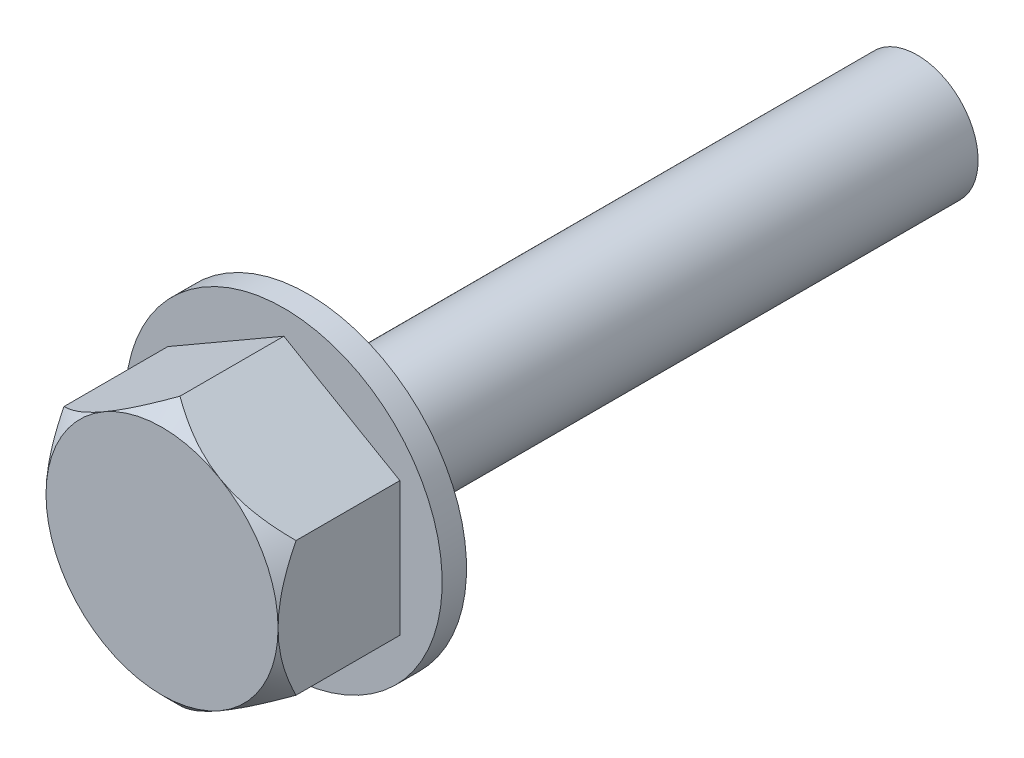
ISO-10303-21;
HEADER;
FILE_DESCRIPTION(('STEP AP214'),'2;1');
FILE_NAME('part.step','',(''),(''),'','','');
FILE_SCHEMA(('AUTOMOTIVE_DESIGN { 1 0 10303 214 1 1 1 1 }'));
ENDSEC;
DATA;
#1=APPLICATION_CONTEXT('core data for automotive mechanical design processes');
#2=APPLICATION_PROTOCOL_DEFINITION('international standard','automotive_design',2000,#1);
#3=PRODUCT_CONTEXT('',#1,'mechanical');
#4=PRODUCT('Part','Part','',(#3));
#5=PRODUCT_RELATED_PRODUCT_CATEGORY('part','',(#4));
#6=PRODUCT_DEFINITION_FORMATION('','',#4);
#7=PRODUCT_DEFINITION_CONTEXT('part definition',#1,'design');
#8=PRODUCT_DEFINITION('design','',#6,#7);
#9=PRODUCT_DEFINITION_SHAPE('','',#8);
#10=(LENGTH_UNIT() NAMED_UNIT(*) SI_UNIT(.MILLI.,.METRE.));
#11=(NAMED_UNIT(*) PLANE_ANGLE_UNIT() SI_UNIT($,.RADIAN.));
#12=(NAMED_UNIT(*) SI_UNIT($,.STERADIAN.) SOLID_ANGLE_UNIT());
#13=UNCERTAINTY_MEASURE_WITH_UNIT(LENGTH_MEASURE(1.E-05),#10,'distance_accuracy_value','');
#14=(GEOMETRIC_REPRESENTATION_CONTEXT(3) GLOBAL_UNCERTAINTY_ASSIGNED_CONTEXT((#13)) GLOBAL_UNIT_ASSIGNED_CONTEXT((#10,
#11,#12)) REPRESENTATION_CONTEXT('',''));
#15=CARTESIAN_POINT('',(0.,0.,0.));
#16=DIRECTION('',(0.,0.,1.));
#17=DIRECTION('',(1.,0.,0.));
#18=AXIS2_PLACEMENT_3D('',#15,#16,#17);
#19=CARTESIAN_POINT('',(-4.76313972081438,-2.75000000000005,-5.));
#20=DIRECTION('',(-0.499999999999995,-0.866025403784441,0.));
#21=DIRECTION('',(0.866025403784441,-0.499999999999995,0.));
#22=AXIS2_PLACEMENT_3D('',#19,#20,#21);
#23=PLANE('',#22);
#24=DIRECTION('',(0.,0.,1.));
#25=VECTOR('',#24,1.);
#26=CARTESIAN_POINT('',(0.,-5.5,-5.));
#27=LINE('',#26,#25);
#28=CARTESIAN_POINT('',(0.,-5.5,-5.));
#29=VERTEX_POINT('',#28);
#30=CARTESIAN_POINT('',(0.,-5.5,-0.736860279185588));
#31=VERTEX_POINT('',#30);
#32=EDGE_CURVE('E125',#29,#31,#27,.T.);
#33=ORIENTED_EDGE('',*,*,#32,.T.);
#34=CARTESIAN_POINT('',(0.000199999999999947,-5.50011547005384,-0.736975752875714));
#35=CARTESIAN_POINT('',(-0.0817003470262866,-5.45283028265149,-0.689694685548292));
#36=CARTESIAN_POINT('',(-0.164230225744076,-5.40518163495759,-0.643864576965731));
#37=CARTESIAN_POINT('',(-0.330672557559919,-5.30908610987916,-0.555547663203381));
#38=CARTESIAN_POINT('',(-0.414585735957058,-5.26063881374302,-0.513062684050777));
#39=CARTESIAN_POINT('',(-0.669365101218748,-5.11354187862522,-0.390925204626404));
#40=CARTESIAN_POINT('',(-0.84238815690256,-5.01364697085016,-0.317111231818438));
#41=CARTESIAN_POINT('',(-1.19130301448484,-4.81220088390078,-0.190709770145647));
#42=CARTESIAN_POINT('',(-1.3671056306834,-4.7107011961143,-0.137803823169366));
#43=CARTESIAN_POINT('',(-1.63369990023506,-4.55678292282424,-0.0766045532619521));
#44=CARTESIAN_POINT('',(-1.72295716505968,-4.50525021695061,-0.0592395898835631));
#45=CARTESIAN_POINT('',(-1.90222747152857,-4.4017484572531,-0.0309558439278378));
#46=CARTESIAN_POINT('',(-1.99224039817511,-4.34977946982317,-0.0200360979179911));
#47=CARTESIAN_POINT('',(-2.21158720877784,-4.2231395296758,-0.00172772122849488));
#48=CARTESIAN_POINT('',(-2.34115742565004,-4.14833213008567,0.00211388269245642));
#49=CARTESIAN_POINT('',(-2.60006435339632,-3.9988521456563,-0.00433297330770614));
#50=CARTESIAN_POINT('',(-2.72940096650445,-3.92417961726225,-0.0146263864778779));
#51=CARTESIAN_POINT('',(-2.9868548554005,-3.7755385452042,-0.0487365191046505));
#52=CARTESIAN_POINT('',(-3.11497060430222,-3.70157088308837,-0.0725683627031131));
#53=CARTESIAN_POINT('',(-3.36900011460575,-3.55490687693252,-0.132459701208678));
#54=CARTESIAN_POINT('',(-3.49491404406779,-3.48221043586288,-0.168518258554821));
#55=CARTESIAN_POINT('',(-3.71843824070332,-3.35315868076497,-0.242703334416508));
#56=CARTESIAN_POINT('',(-3.81654337228758,-3.29651765663591,-0.2788791293767));
#57=CARTESIAN_POINT('',(-4.01099245484344,-3.18425242647861,-0.357060576143164));
#58=CARTESIAN_POINT('',(-4.1073363522142,-3.12862825139682,-0.399066405045612));
#59=CARTESIAN_POINT('',(-4.2979595242532,-3.01857191170633,-0.487966239375994));
#60=CARTESIAN_POINT('',(-4.39224422044242,-2.96413661698102,-0.53484487306658));
#61=CARTESIAN_POINT('',(-4.57906764030394,-2.85627406523305,-0.632874795145085));
#62=CARTESIAN_POINT('',(-4.67160739285723,-2.80284621418566,-0.684023462634268));
#63=CARTESIAN_POINT('',(-4.76333972081438,-2.74988452994622,-0.736975752875713));
#64=B_SPLINE_CURVE_WITH_KNOTS('',3,(#34,#35,#36,#37,#38,#39,#40,#41,#42,#43,#44,#45,#46,#47,#48,
#49,#50,#51,#52,#53,#54,#55,#56,#57,#58,#59,#60,#61,#62,#63),.UNSPECIFIED.,.F.,.F.,(4,2,2,2,2,2,
2,2,2,2,2,2,2,2,4),(0.,0.317174593195835,0.634521141153642,1.27264058749772,1.90062684773362,
2.21400406042552,2.52733441755152,2.97562912372917,3.42408096321992,3.87303476817696,
4.32195415453099,4.67854100660272,5.03513869291573,5.39064376324431,5.74593221064629),.UNSPECIFIED.);
#65=CARTESIAN_POINT('',(-2.38156986040718,-4.12500000000001,0.));
#66=VERTEX_POINT('',#65);
#67=EDGE_CURVE('E63',#31,#66,#64,.T.);
#68=ORIENTED_EDGE('',*,*,#67,.T.);
#69=CARTESIAN_POINT('',(-4.76313972081438,-2.75000000000005,-0.736860279185588));
#70=VERTEX_POINT('',#69);
#71=EDGE_CURVE('E137',#66,#70,#64,.T.);
#72=ORIENTED_EDGE('',*,*,#71,.T.);
#73=DIRECTION('',(0.,0.,1.));
#74=VECTOR('',#73,1.);
#75=CARTESIAN_POINT('',(-4.76313972081438,-2.75000000000005,-5.));
#76=LINE('',#75,#74);
#77=CARTESIAN_POINT('',(-4.76313972081438,-2.75000000000005,-5.));
#78=VERTEX_POINT('',#77);
#79=EDGE_CURVE('E134',#78,#70,#76,.T.);
#80=ORIENTED_EDGE('',*,*,#79,.F.);
#81=DIRECTION('',(0.866025403784441,-0.499999999999995,0.));
#82=VECTOR('',#81,1.);
#83=CARTESIAN_POINT('',(-4.76313972081438,-2.75000000000005,-5.));
#84=LINE('',#83,#82);
#85=EDGE_CURVE('E116',#78,#29,#84,.T.);
#86=ORIENTED_EDGE('',*,*,#85,.T.);
#87=EDGE_LOOP('',(#33,#68,#72,#80,#86));
#88=FACE_BOUND('',#87,.T.);
#89=ADVANCED_FACE('F38',(#88),#23,.T.);
#90=CARTESIAN_POINT('',(-4.76313972081444,2.74999999999996,-5.));
#91=DIRECTION('',(-1.,0.,0.));
#92=DIRECTION('',(0.,-1.,0.));
#93=AXIS2_PLACEMENT_3D('',#90,#91,#92);
#94=PLANE('',#93);
#95=ORIENTED_EDGE('',*,*,#79,.T.);
#96=CARTESIAN_POINT('',(-4.7631397208143,-9.96474736936947,-6.28148295881364));
#97=CARTESIAN_POINT('',(-4.76313972081431,-9.8194641237829,-6.15040750400947));
#98=CARTESIAN_POINT('',(-4.76313972081431,-9.67391870517606,-6.01962248484121));
#99=CARTESIAN_POINT('',(-4.76313972081431,-9.38223157542293,-5.75871878164263));
#100=CARTESIAN_POINT('',(-4.76313972081431,-9.23608986338274,-5.62860009861187));
#101=CARTESIAN_POINT('',(-4.76313972081432,-8.79657578364714,-5.23929506633062));
#102=CARTESIAN_POINT('',(-4.76313972081432,-8.50220091479208,-4.9812379021764));
#103=CARTESIAN_POINT('',(-4.76313972081433,-7.90709800761804,-4.46654620790231));
#104=CARTESIAN_POINT('',(-4.76313972081433,-7.60633593823235,-4.20995088688188));
#105=CARTESIAN_POINT('',(-4.76313972081433,-7.15176487956565,-3.82920746179781));
#106=CARTESIAN_POINT('',(-4.76313972081434,-6.99968458283192,-3.7029964571668));
#107=CARTESIAN_POINT('',(-4.76313972081434,-6.69416963001136,-3.4522001511214));
#108=CARTESIAN_POINT('',(-4.76313972081434,-6.54073486069522,-3.32761498782123));
#109=CARTESIAN_POINT('',(-4.76313972081434,-6.10924062059504,-2.98170821248723));
#110=CARTESIAN_POINT('',(-4.76313972081435,-5.82944384431965,-2.76253177121416));
#111=CARTESIAN_POINT('',(-4.76313972081435,-5.40476464042109,-2.44036994149421));
#112=CARTESIAN_POINT('',(-4.76313972081435,-5.26238112901092,-2.33408803915039));
#113=CARTESIAN_POINT('',(-4.76313972081436,-4.97566966699846,-2.12418414246091));
#114=CARTESIAN_POINT('',(-4.76313972081436,-4.83134179195008,-2.0205620452128));
#115=CARTESIAN_POINT('',(-4.76313972081436,-4.5407079622675,-1.81674023917084));
#116=CARTESIAN_POINT('',(-4.76313972081436,-4.39440647213127,-1.71653418147474));
#117=CARTESIAN_POINT('',(-4.76313972081437,-4.09918613232495,-1.52006674655576));
#118=CARTESIAN_POINT('',(-4.76313972081437,-3.95026750137534,-1.42380504191322));
#119=CARTESIAN_POINT('',(-4.76313972081437,-3.64947681847324,-1.23622397003319));
#120=CARTESIAN_POINT('',(-4.76313972081437,-3.49760685430108,-1.14490127037007));
#121=CARTESIAN_POINT('',(-4.76313972081438,-3.19036684314799,-0.968363616521689));
#122=CARTESIAN_POINT('',(-4.76313972081438,-3.0349973680281,-0.883147673802277));
#123=CARTESIAN_POINT('',(-4.76313972081438,-2.72949302776217,-0.725171508495284));
#124=CARTESIAN_POINT('',(-4.76313972081438,-2.57958588365036,-0.651973831254236));
#125=CARTESIAN_POINT('',(-4.76313972081438,-2.27587119230448,-0.514055337321866));
#126=CARTESIAN_POINT('',(-4.76313972081439,-2.1220633759172,-0.449335107499267));
#127=CARTESIAN_POINT('',(-4.76313972081439,-1.81074973674743,-0.330549568695687));
#128=CARTESIAN_POINT('',(-4.76313972081439,-1.65325331142752,-0.276459911575746));
#129=CARTESIAN_POINT('',(-4.76313972081439,-1.3344497210784,-0.181066001857871));
#130=CARTESIAN_POINT('',(-4.7631397208144,-1.17314446724577,-0.139755477750318));
#131=CARTESIAN_POINT('',(-4.7631397208144,-0.87326689022643,-0.0775352041917559));
#132=CARTESIAN_POINT('',(-4.7631397208144,-0.73515336354498,-0.0544272815044862));
#133=CARTESIAN_POINT('',(-4.7631397208144,-0.457466196822941,-0.0199360371249379));
#134=CARTESIAN_POINT('',(-4.76313972081441,-0.317892786174683,-0.00855090057246982));
#135=CARTESIAN_POINT('',(-4.76313972081441,-0.0384574659023621,0.00188822402369194));
#136=CARTESIAN_POINT('',(-4.76313972081441,0.101403843691035,0.000958016781422012));
#137=CARTESIAN_POINT('',(-4.76313972081441,0.380512188123441,-0.0131398272199835));
#138=CARTESIAN_POINT('',(-4.76313972081441,0.519759136740562,-0.02630913000906));
#139=CARTESIAN_POINT('',(-4.76313972081442,0.830680905799937,-0.0688750596399007));
#140=CARTESIAN_POINT('',(-4.76313972081442,1.00191866122046,-0.101463313009136));
#141=CARTESIAN_POINT('',(-4.76313972081442,1.34068148647521,-0.182342635637698));
#142=CARTESIAN_POINT('',(-4.76313972081442,1.50820424110581,-0.230643218550643));
#143=CARTESIAN_POINT('',(-4.76313972081443,1.75661452670975,-0.312984909706596));
#144=CARTESIAN_POINT('',(-4.76313972081443,1.83915865201396,-0.342173222657684));
#145=CARTESIAN_POINT('',(-4.76313972081443,2.00310532499562,-0.403499071646121));
#146=CARTESIAN_POINT('',(-4.76313972081443,2.0845083693278,-0.435635275570389));
#147=CARTESIAN_POINT('',(-4.76313972081443,2.24620795881391,-0.502553921075972));
#148=CARTESIAN_POINT('',(-4.76313972081443,2.32650458018099,-0.537336179303356));
#149=CARTESIAN_POINT('',(-4.76313972081443,2.48603613357505,-0.609272841131835));
#150=CARTESIAN_POINT('',(-4.76313972081444,2.56527092702329,-0.646427550782213));
#151=CARTESIAN_POINT('',(-4.76313972081444,2.89412413331974,-0.806015832116659));
#152=CARTESIAN_POINT('',(-4.76313972081444,3.13912931524198,-0.938004938001573));
#153=CARTESIAN_POINT('',(-4.76313972081445,3.62066445143717,-1.21667499148629));
#154=CARTESIAN_POINT('',(-4.76313972081445,3.85718803181078,-1.36336668638422));
#155=CARTESIAN_POINT('',(-4.76313972081445,4.3240244071607,-1.66751266588977));
#156=CARTESIAN_POINT('',(-4.76313972081446,4.55431987438763,-1.82499337675008));
#157=CARTESIAN_POINT('',(-4.76313972081446,5.0094539624986,-2.14745934347511));
#158=CARTESIAN_POINT('',(-4.76313972081446,5.23429412427803,-2.31244244147846));
#159=CARTESIAN_POINT('',(-4.76313972081447,5.68080506105937,-2.64883795112529));
#160=CARTESIAN_POINT('',(-4.76313972081447,5.90245519471754,-2.82027764698549));
#161=CARTESIAN_POINT('',(-4.76313972081447,6.34235286574879,-3.16747927973048));
#162=CARTESIAN_POINT('',(-4.76313972081448,6.56060020491732,-3.34324146686448));
#163=CARTESIAN_POINT('',(-4.76313972081448,6.99405466123267,-3.69787684812839));
#164=CARTESIAN_POINT('',(-4.76313972081448,7.20926548390335,-3.87674552356452));
#165=CARTESIAN_POINT('',(-4.76313972081449,7.63744961082177,-4.23712665270878));
#166=CARTESIAN_POINT('',(-4.76313972081449,7.85042296288583,-4.41863904972009));
#167=CARTESIAN_POINT('',(-4.7631397208145,8.38422376965678,-4.87822108752157));
#168=CARTESIAN_POINT('',(-4.7631397208145,8.70386035988949,-5.15767346824373));
#169=CARTESIAN_POINT('',(-4.7631397208145,9.17978597667877,-5.57855211265872));
#170=CARTESIAN_POINT('',(-4.76313972081451,9.33727992750878,-5.7186219806635));
#171=CARTESIAN_POINT('',(-4.76313972081451,9.65153287771948,-5.99950988397989));
#172=CARTESIAN_POINT('',(-4.76313972081451,9.80829204097808,-6.14032773590688));
#173=CARTESIAN_POINT('',(-4.76313972081451,9.96474736936938,-6.28148295881362));
#174=B_SPLINE_CURVE_WITH_KNOTS('',3,(#96,#97,#98,#99,#100,#101,#102,#103,#104,#105,#106,#107,
#108,#109,#110,#111,#112,#113,#114,#115,#116,#117,#118,#119,#120,#121,#122,#123,#124,#125,#126,
#127,#128,#129,#130,#131,#132,#133,#134,#135,#136,#137,#138,#139,#140,#141,#142,#143,#144,#145,
#146,#147,#148,#149,#150,#151,#152,#153,#154,#155,#156,#157,#158,#159,#160,#161,#162,#163,#164,
#165,#166,#167,#168,#169,#170,#171,#172,#173),.UNSPECIFIED.,.F.,.F.,(4,2,2,2,2,2,2,2,2,2,2,2,2,
2,2,2,2,2,2,2,2,2,2,2,2,2,2,2,2,2,2,2,2,2,2,2,2,2,4),(0.,0.587019100354334,1.17403908103397,
2.34842866011225,3.53441461258711,4.12729414409058,4.72022371672311,5.78633737356322,
6.31934345914652,6.85232889262923,7.38426276308394,7.91615238803062,8.44767854283795,
8.97911846132891,9.47937767016599,9.97967149219264,10.4788057402889,10.9776946423464,
11.3973410781643,11.816922536752,12.235965583942,12.6550656811429,13.1771207995729,
13.6994926071962,13.9621052178759,14.2245997365447,14.4870760826313,14.7495863571789,
15.5836094863241,16.4182467786879,17.2550070219913,18.0915280972779,18.9321033310732,
19.7727273447939,20.6122168659544,21.4516884099938,22.7253609187822,23.3576687618174,
23.9898281446097),.UNSPECIFIED.);
#175=CARTESIAN_POINT('',(-4.76313972081441,0.,0.));
#176=VERTEX_POINT('',#175);
#177=EDGE_CURVE('E247',#70,#176,#174,.T.);
#178=ORIENTED_EDGE('',*,*,#177,.T.);
#179=CARTESIAN_POINT('',(-4.76313972081444,2.74999999999996,-0.736860279185588));
#180=VERTEX_POINT('',#179);
#181=EDGE_CURVE('E220',#176,#180,#174,.T.);
#182=ORIENTED_EDGE('',*,*,#181,.T.);
#183=DIRECTION('',(0.,0.,1.));
#184=VECTOR('',#183,1.);
#185=CARTESIAN_POINT('',(-4.76313972081444,2.74999999999996,-5.));
#186=LINE('',#185,#184);
#187=CARTESIAN_POINT('',(-4.76313972081444,2.74999999999996,-5.));
#188=VERTEX_POINT('',#187);
#189=EDGE_CURVE('E155',#188,#180,#186,.T.);
#190=ORIENTED_EDGE('',*,*,#189,.F.);
#191=DIRECTION('',(0.,-1.,0.));
#192=VECTOR('',#191,1.);
#193=CARTESIAN_POINT('',(-4.76313972081444,2.74999999999996,-5.));
#194=LINE('',#193,#192);
#195=EDGE_CURVE('E131',#188,#78,#194,.T.);
#196=ORIENTED_EDGE('',*,*,#195,.T.);
#197=EDGE_LOOP('',(#95,#178,#182,#190,#196));
#198=FACE_BOUND('',#197,.T.);
#199=ADVANCED_FACE('F229',(#198),#94,.T.);
#200=CARTESIAN_POINT('',(0.,5.5,-5.));
#201=DIRECTION('',(-0.500000000000007,0.866025403784435,0.));
#202=DIRECTION('',(-0.866025403784435,-0.500000000000007,0.));
#203=AXIS2_PLACEMENT_3D('',#200,#201,#202);
#204=PLANE('',#203);
#205=ORIENTED_EDGE('',*,*,#189,.T.);
#206=CARTESIAN_POINT('',(-4.76333972081444,2.74988452994612,-0.736975752875713));
#207=CARTESIAN_POINT('',(-4.68143937378815,2.79716971734847,-0.68969468554829));
#208=CARTESIAN_POINT('',(-4.59890949507036,2.84481836504237,-0.643864576965729));
#209=CARTESIAN_POINT('',(-4.43246716325452,2.9409138901208,-0.555547663203377));
#210=CARTESIAN_POINT('',(-4.34855398485738,2.98936118625695,-0.513062684050771));
#211=CARTESIAN_POINT('',(-4.09377461959569,3.13645812137475,-0.390925204626394));
#212=CARTESIAN_POINT('',(-3.92075156391187,3.23635302914981,-0.317111231818426));
#213=CARTESIAN_POINT('',(-3.5718367063296,3.4377991160992,-0.190709770145632));
#214=CARTESIAN_POINT('',(-3.39603409013103,3.53929880388569,-0.13780382316935));
#215=CARTESIAN_POINT('',(-3.12943982057938,3.69321707717575,-0.0766045532619348));
#216=CARTESIAN_POINT('',(-3.04018255575475,3.74474978304938,-0.0592395898835454));
#217=CARTESIAN_POINT('',(-2.86091224928586,3.8482515427469,-0.0309558439278192));
#218=CARTESIAN_POINT('',(-2.77089932263932,3.90022053017683,-0.0200360979179722));
#219=CARTESIAN_POINT('',(-2.5515525120366,4.0268604703242,-0.00172772122847576));
#220=CARTESIAN_POINT('',(-2.42198229516439,4.10166786991433,0.00211388269247535));
#221=CARTESIAN_POINT('',(-2.16307536741811,4.2511478543437,-0.00433297330768649));
#222=CARTESIAN_POINT('',(-2.03373875430998,4.32582038273776,-0.0146263864778574));
#223=CARTESIAN_POINT('',(-1.77628486541394,4.47446145479581,-0.0487365191046294));
#224=CARTESIAN_POINT('',(-1.64816911651222,4.54842911691164,-0.0725683627030924));
#225=CARTESIAN_POINT('',(-1.3941396062087,4.6950931230675,-0.132459701208658));
#226=CARTESIAN_POINT('',(-1.26822567674666,4.76778956413713,-0.1685182585548));
#227=CARTESIAN_POINT('',(-1.04470148011113,4.89684131923505,-0.242703334416488));
#228=CARTESIAN_POINT('',(-0.946596348526861,4.95348234336411,-0.27887912937668));
#229=CARTESIAN_POINT('',(-0.752147265970998,5.06574757352142,-0.357060576143148));
#230=CARTESIAN_POINT('',(-0.655803368600229,5.12137174860321,-0.399066405045598));
#231=CARTESIAN_POINT('',(-0.465180196561227,5.23142808829371,-0.487966239375983));
#232=CARTESIAN_POINT('',(-0.370895500372006,5.28586338301902,-0.534844873066572));
#233=CARTESIAN_POINT('',(-0.18407208051048,5.393725934767,-0.632874795145081));
#234=CARTESIAN_POINT('',(-0.0915323279571858,5.44715378581439,-0.684023462634266));
#235=CARTESIAN_POINT('',(0.000199999999962002,5.50011547005384,-0.736975752875713));
#236=B_SPLINE_CURVE_WITH_KNOTS('',3,(#206,#207,#208,#209,#210,#211,#212,#213,#214,#215,#216,
#217,#218,#219,#220,#221,#222,#223,#224,#225,#226,#227,#228,#229,#230,#231,#232,#233,#234,#235),
.UNSPECIFIED.,.F.,.F.,(4,2,2,2,2,2,2,2,2,2,2,2,2,2,4),(0.,0.317174593195838,0.634521141153649,
1.27264058749774,1.90062684773364,2.21400406042555,2.52733441755155,2.9756291237292,
3.42408096321995,3.87303476817699,4.32195415453101,4.67854100660276,5.03513869291578,
5.39064376324437,5.74593221064637),.UNSPECIFIED.);
#237=CARTESIAN_POINT('',(-2.38156986040724,4.12499999999998,0.));
#238=VERTEX_POINT('',#237);
#239=EDGE_CURVE('E218',#180,#238,#236,.T.);
#240=ORIENTED_EDGE('',*,*,#239,.T.);
#241=CARTESIAN_POINT('',(0.,5.5,-0.736860279185588));
#242=VERTEX_POINT('',#241);
#243=EDGE_CURVE('E211',#238,#242,#236,.T.);
#244=ORIENTED_EDGE('',*,*,#243,.T.);
#245=DIRECTION('',(0.,0.,1.));
#246=VECTOR('',#245,1.);
#247=CARTESIAN_POINT('',(0.,5.5,-5.));
#248=LINE('',#247,#246);
#249=CARTESIAN_POINT('',(0.,5.5,-5.));
#250=VERTEX_POINT('',#249);
#251=EDGE_CURVE('E158',#250,#242,#248,.T.);
#252=ORIENTED_EDGE('',*,*,#251,.F.);
#253=DIRECTION('',(-0.866025403784434,-0.500000000000007,0.));
#254=VECTOR('',#253,1.);
#255=CARTESIAN_POINT('',(0.,5.5,-5.));
#256=LINE('',#255,#254);
#257=EDGE_CURVE('E150',#250,#188,#256,.T.);
#258=ORIENTED_EDGE('',*,*,#257,.T.);
#259=EDGE_LOOP('',(#205,#240,#244,#252,#258));
#260=FACE_BOUND('',#259,.T.);
#261=ADVANCED_FACE('F225',(#260),#204,.T.);
#262=CARTESIAN_POINT('',(4.7631397208144,2.75000000000002,-5.));
#263=DIRECTION('',(0.499999999999995,0.866025403784442,0.));
#264=DIRECTION('',(-0.866025403784442,0.499999999999995,0.));
#265=AXIS2_PLACEMENT_3D('',#262,#263,#264);
#266=PLANE('',#265);
#267=ORIENTED_EDGE('',*,*,#251,.T.);
#268=CARTESIAN_POINT('',(-0.000200000000038219,5.50011547005384,-0.736975752875713));
#269=CARTESIAN_POINT('',(0.0817003470262488,5.45283028265149,-0.68969468554829));
#270=CARTESIAN_POINT('',(0.164230225744038,5.40518163495758,-0.643864576965728));
#271=CARTESIAN_POINT('',(0.330672557559883,5.30908610987916,-0.555547663203377));
#272=CARTESIAN_POINT('',(0.414585735957023,5.26063881374301,-0.513062684050771));
#273=CARTESIAN_POINT('',(0.669365101218715,5.11354187862521,-0.390925204626395));
#274=CARTESIAN_POINT('',(0.842388156902529,5.01364697085016,-0.317111231818427));
#275=CARTESIAN_POINT('',(1.19130301448481,4.81220088390077,-0.190709770145633));
#276=CARTESIAN_POINT('',(1.36710563068337,4.71070119611429,-0.13780382316935));
#277=CARTESIAN_POINT('',(1.63369990023503,4.55678292282423,-0.0766045532619356));
#278=CARTESIAN_POINT('',(1.72295716505966,4.5052502169506,-0.0592395898835468));
#279=CARTESIAN_POINT('',(1.90222747152855,4.40174845725308,-0.0309558439278207));
#280=CARTESIAN_POINT('',(1.99224039817509,4.34977946982316,-0.0200360979179731));
#281=CARTESIAN_POINT('',(2.21158720877782,4.22313952967579,-0.00172772122847552));
#282=CARTESIAN_POINT('',(2.34115742565002,4.14833213008566,0.0021138826924761));
#283=CARTESIAN_POINT('',(2.6000643533963,3.99885214565629,-0.00433297330768594));
#284=CARTESIAN_POINT('',(2.72940096650443,3.92417961726224,-0.0146263864778576));
#285=CARTESIAN_POINT('',(2.98685485540048,3.77553854520419,-0.0487365191046295));
#286=CARTESIAN_POINT('',(3.1149706043022,3.70157088308836,-0.0725683627030915));
#287=CARTESIAN_POINT('',(3.36900011460573,3.55490687693251,-0.132459701208656));
#288=CARTESIAN_POINT('',(3.49491404406776,3.48221043586288,-0.168518258554797));
#289=CARTESIAN_POINT('',(3.71843824070329,3.35315868076496,-0.242703334416486));
#290=CARTESIAN_POINT('',(3.81654337228756,3.2965176566359,-0.278879129376678));
#291=CARTESIAN_POINT('',(4.01099245484343,3.1842524264786,-0.357060576143147));
#292=CARTESIAN_POINT('',(4.1073363522142,3.1286282513968,-0.399066405045597));
#293=CARTESIAN_POINT('',(4.29795952425321,3.01857191170631,-0.487966239375983));
#294=CARTESIAN_POINT('',(4.39224422044243,2.964136616981,-0.534844873066572));
#295=CARTESIAN_POINT('',(4.57906764030396,2.85627406523302,-0.632874795145081));
#296=CARTESIAN_POINT('',(4.67160739285725,2.80284621418563,-0.684023462634267));
#297=CARTESIAN_POINT('',(4.7633397208144,2.74988452994618,-0.736975752875714));
#298=B_SPLINE_CURVE_WITH_KNOTS('',3,(#268,#269,#270,#271,#272,#273,#274,#275,#276,#277,#278,
#279,#280,#281,#282,#283,#284,#285,#286,#287,#288,#289,#290,#291,#292,#293,#294,#295,#296,#297),
.UNSPECIFIED.,.F.,.F.,(4,2,2,2,2,2,2,2,2,2,2,2,2,2,4),(0.,0.317174593195838,0.634521141153649,
1.27264058749773,1.90062684773364,2.21400406042554,2.52733441755154,2.9756291237292,
3.42408096321995,3.87303476817698,4.32195415453101,4.67854100660275,5.03513869291578,
5.39064376324438,5.74593221064637),.UNSPECIFIED.);
#299=CARTESIAN_POINT('',(2.38156986040718,4.12500000000001,0.));
#300=VERTEX_POINT('',#299);
#301=EDGE_CURVE('E219',#242,#300,#298,.T.);
#302=ORIENTED_EDGE('',*,*,#301,.T.);
#303=CARTESIAN_POINT('',(4.7631397208144,2.75000000000002,-0.736860279185588));
#304=VERTEX_POINT('',#303);
#305=EDGE_CURVE('E175',#300,#304,#298,.T.);
#306=ORIENTED_EDGE('',*,*,#305,.T.);
#307=DIRECTION('',(0.,0.,1.));
#308=VECTOR('',#307,1.);
#309=CARTESIAN_POINT('',(4.7631397208144,2.75000000000002,-5.));
#310=LINE('',#309,#308);
#311=CARTESIAN_POINT('',(4.7631397208144,2.75000000000002,-5.));
#312=VERTEX_POINT('',#311);
#313=EDGE_CURVE('E161',#312,#304,#310,.T.);
#314=ORIENTED_EDGE('',*,*,#313,.F.);
#315=DIRECTION('',(-0.866025403784441,0.499999999999995,0.));
#316=VECTOR('',#315,1.);
#317=CARTESIAN_POINT('',(4.7631397208144,2.75000000000002,-5.));
#318=LINE('',#317,#316);
#319=EDGE_CURVE('E147',#312,#250,#318,.T.);
#320=ORIENTED_EDGE('',*,*,#319,.T.);
#321=EDGE_LOOP('',(#267,#302,#306,#314,#320));
#322=FACE_BOUND('',#321,.T.);
#323=ADVANCED_FACE('F228',(#322),#266,.T.);
#324=CARTESIAN_POINT('',(4.76313972081442,-2.74999999999999,-5.));
#325=DIRECTION('',(1.,0.,0.));
#326=DIRECTION('',(0.,1.,0.));
#327=AXIS2_PLACEMENT_3D('',#324,#325,#326);
#328=PLANE('',#327);
#329=ORIENTED_EDGE('',*,*,#313,.T.);
#330=CARTESIAN_POINT('',(4.76313972081438,9.96474736936943,-6.28148295881364));
#331=CARTESIAN_POINT('',(4.76313972081438,9.81946412378287,-6.15040750400947));
#332=CARTESIAN_POINT('',(4.76313972081438,9.67391870517603,-6.01962248484121));
#333=CARTESIAN_POINT('',(4.76313972081438,9.3822315754229,-5.75871878164263));
#334=CARTESIAN_POINT('',(4.76313972081438,9.23608986338271,-5.62860009861187));
#335=CARTESIAN_POINT('',(4.76313972081438,8.79657578364711,-5.23929506633062));
#336=CARTESIAN_POINT('',(4.76313972081438,8.50220091479205,-4.9812379021764));
#337=CARTESIAN_POINT('',(4.76313972081438,7.90709800761801,-4.4665462079023));
#338=CARTESIAN_POINT('',(4.76313972081438,7.60633593823232,-4.20995088688188));
#339=CARTESIAN_POINT('',(4.76313972081438,7.15176487956561,-3.82920746179781));
#340=CARTESIAN_POINT('',(4.76313972081439,6.99968458283189,-3.7029964571668));
#341=CARTESIAN_POINT('',(4.76313972081439,6.69416963001133,-3.4522001511214));
#342=CARTESIAN_POINT('',(4.76313972081439,6.54073486069519,-3.32761498782123));
#343=CARTESIAN_POINT('',(4.76313972081439,6.109240620595,-2.98170821248723));
#344=CARTESIAN_POINT('',(4.76313972081439,5.82944384431962,-2.76253177121415));
#345=CARTESIAN_POINT('',(4.76313972081439,5.40476464042106,-2.44036994149421));
#346=CARTESIAN_POINT('',(4.76313972081439,5.26238112901089,-2.33408803915039));
#347=CARTESIAN_POINT('',(4.76313972081439,4.97566966699843,-2.12418414246091));
#348=CARTESIAN_POINT('',(4.76313972081439,4.83134179195004,-2.0205620452128));
#349=CARTESIAN_POINT('',(4.76313972081439,4.54070796226747,-1.81674023917084));
#350=CARTESIAN_POINT('',(4.76313972081439,4.39440647213124,-1.71653418147474));
#351=CARTESIAN_POINT('',(4.76313972081439,4.09918613232492,-1.52006674655576));
#352=CARTESIAN_POINT('',(4.7631397208144,3.95026750137531,-1.42380504191322));
#353=CARTESIAN_POINT('',(4.7631397208144,3.6494768184732,-1.23622397003319));
#354=CARTESIAN_POINT('',(4.7631397208144,3.49760685430104,-1.14490127037007));
#355=CARTESIAN_POINT('',(4.7631397208144,3.19036684314795,-0.968363616521688));
#356=CARTESIAN_POINT('',(4.7631397208144,3.03499736802806,-0.883147673802276));
#357=CARTESIAN_POINT('',(4.7631397208144,2.72949302776213,-0.725171508495283));
#358=CARTESIAN_POINT('',(4.7631397208144,2.57958588365032,-0.651973831254235));
#359=CARTESIAN_POINT('',(4.7631397208144,2.27587119230445,-0.514055337321865));
#360=CARTESIAN_POINT('',(4.7631397208144,2.12206337591716,-0.449335107499265));
#361=CARTESIAN_POINT('',(4.7631397208144,1.81074973674739,-0.330549568695685));
#362=CARTESIAN_POINT('',(4.7631397208144,1.65325331142748,-0.276459911575744));
#363=CARTESIAN_POINT('',(4.76313972081441,1.33444972107836,-0.18106600185787));
#364=CARTESIAN_POINT('',(4.76313972081441,1.17314446724573,-0.139755477750318));
#365=CARTESIAN_POINT('',(4.76313972081441,0.873266890226392,-0.0775352041917559));
#366=CARTESIAN_POINT('',(4.76313972081441,0.735153363544943,-0.0544272815044864));
#367=CARTESIAN_POINT('',(4.76313972081441,0.457466196822903,-0.0199360371249385));
#368=CARTESIAN_POINT('',(4.76313972081441,0.317892786174646,-0.00855090057247068));
#369=CARTESIAN_POINT('',(4.76313972081441,0.0384574659023256,0.00188822402369117));
#370=CARTESIAN_POINT('',(4.76313972081441,-0.101403843691071,0.000958016781421545));
#371=CARTESIAN_POINT('',(4.76313972081441,-0.380512188123478,-0.0131398272199839));
#372=CARTESIAN_POINT('',(4.76313972081441,-0.519759136740599,-0.0263091300090608));
#373=CARTESIAN_POINT('',(4.76313972081441,-0.830680905799974,-0.068875059639902));
#374=CARTESIAN_POINT('',(4.76313972081441,-1.0019186612205,-0.101463313009138));
#375=CARTESIAN_POINT('',(4.76313972081441,-1.34068148647525,-0.182342635637699));
#376=CARTESIAN_POINT('',(4.76313972081441,-1.50820424110585,-0.230643218550645));
#377=CARTESIAN_POINT('',(4.76313972081442,-1.75661452670979,-0.312984909706598));
#378=CARTESIAN_POINT('',(4.76313972081442,-1.839158652014,-0.342173222657686));
#379=CARTESIAN_POINT('',(4.76313972081442,-2.00310532499566,-0.403499071646124));
#380=CARTESIAN_POINT('',(4.76313972081442,-2.08450836932784,-0.435635275570391));
#381=CARTESIAN_POINT('',(4.76313972081442,-2.24620795881395,-0.502553921075975));
#382=CARTESIAN_POINT('',(4.76313972081442,-2.32650458018103,-0.53733617930336));
#383=CARTESIAN_POINT('',(4.76313972081442,-2.48603613357509,-0.609272841131839));
#384=CARTESIAN_POINT('',(4.76313972081442,-2.56527092702333,-0.646427550782216));
#385=CARTESIAN_POINT('',(4.76313972081442,-2.89412413331978,-0.806015832116663));
#386=CARTESIAN_POINT('',(4.76313972081442,-3.13912931524201,-0.938004938001577));
#387=CARTESIAN_POINT('',(4.76313972081442,-3.62066445143721,-1.21667499148629));
#388=CARTESIAN_POINT('',(4.76313972081442,-3.85718803181082,-1.36336668638422));
#389=CARTESIAN_POINT('',(4.76313972081442,-4.32402440716075,-1.66751266588978));
#390=CARTESIAN_POINT('',(4.76313972081442,-4.55431987438768,-1.82499337675009));
#391=CARTESIAN_POINT('',(4.76313972081443,-5.00945396249865,-2.14745934347512));
#392=CARTESIAN_POINT('',(4.76313972081443,-5.23429412427808,-2.31244244147848));
#393=CARTESIAN_POINT('',(4.76313972081443,-5.68080506105943,-2.6488379511253));
#394=CARTESIAN_POINT('',(4.76313972081443,-5.90245519471759,-2.82027764698551));
#395=CARTESIAN_POINT('',(4.76313972081443,-6.34235286574884,-3.1674792797305));
#396=CARTESIAN_POINT('',(4.76313972081443,-6.56060020491738,-3.34324146686449));
#397=CARTESIAN_POINT('',(4.76313972081443,-6.99405466123273,-3.69787684812841));
#398=CARTESIAN_POINT('',(4.76313972081443,-7.2092654839034,-3.87674552356454));
#399=CARTESIAN_POINT('',(4.76313972081443,-7.63744961082183,-4.2371266527088));
#400=CARTESIAN_POINT('',(4.76313972081443,-7.85042296288589,-4.41863904972011));
#401=CARTESIAN_POINT('',(4.76313972081444,-8.38422376965683,-4.87822108752159));
#402=CARTESIAN_POINT('',(4.76313972081444,-8.70386035988955,-5.15767346824375));
#403=CARTESIAN_POINT('',(4.76313972081444,-9.17978597667882,-5.57855211265873));
#404=CARTESIAN_POINT('',(4.76313972081444,-9.33727992750883,-5.71862198066351));
#405=CARTESIAN_POINT('',(4.76313972081444,-9.65153287771953,-5.9995098839799));
#406=CARTESIAN_POINT('',(4.76313972081444,-9.80829204097812,-6.14032773590688));
#407=CARTESIAN_POINT('',(4.76313972081444,-9.96474736936941,-6.28148295881362));
#408=B_SPLINE_CURVE_WITH_KNOTS('',3,(#330,#331,#332,#333,#334,#335,#336,#337,#338,#339,#340,
#341,#342,#343,#344,#345,#346,#347,#348,#349,#350,#351,#352,#353,#354,#355,#356,#357,#358,#359,
#360,#361,#362,#363,#364,#365,#366,#367,#368,#369,#370,#371,#372,#373,#374,#375,#376,#377,#378,
#379,#380,#381,#382,#383,#384,#385,#386,#387,#388,#389,#390,#391,#392,#393,#394,#395,#396,#397,
#398,#399,#400,#401,#402,#403,#404,#405,#406,#407),.UNSPECIFIED.,.F.,.F.,(4,2,2,2,2,2,2,2,2,2,2,
2,2,2,2,2,2,2,2,2,2,2,2,2,2,2,2,2,2,2,2,2,2,2,2,2,2,2,4),(0.,0.587019100354332,1.17403908103397,
2.34842866011226,3.53441461258711,4.12729414409058,4.72022371672311,5.78633737356322,
6.31934345914652,6.85232889262923,7.38426276308395,7.91615238803062,8.44767854283795,
8.97911846132892,9.479377670166,9.97967149219265,10.4788057402889,10.9776946423464,
11.3973410781643,11.8169225367521,12.235965583942,12.6550656811429,13.1771207995729,
13.6994926071962,13.9621052178759,14.2245997365447,14.4870760826313,14.749586357179,
15.5836094863241,16.4182467786879,17.2550070219913,18.0915280972779,18.9321033310733,
19.7727273447939,20.6122168659544,21.4516884099938,22.7253609187822,23.3576687618174,
23.9898281446097),.UNSPECIFIED.);
#409=CARTESIAN_POINT('',(4.76313972081441,0.,0.));
#410=VERTEX_POINT('',#409);
#411=EDGE_CURVE('E170',#304,#410,#408,.T.);
#412=ORIENTED_EDGE('',*,*,#411,.T.);
#413=CARTESIAN_POINT('',(4.76313972081442,-2.74999999999999,-0.736860279185588));
#414=VERTEX_POINT('',#413);
#415=EDGE_CURVE('E169',#410,#414,#408,.T.);
#416=ORIENTED_EDGE('',*,*,#415,.T.);
#417=DIRECTION('',(0.,0.,1.));
#418=VECTOR('',#417,1.);
#419=CARTESIAN_POINT('',(4.76313972081442,-2.74999999999999,-5.));
#420=LINE('',#419,#418);
#421=CARTESIAN_POINT('',(4.76313972081442,-2.74999999999999,-5.));
#422=VERTEX_POINT('',#421);
#423=EDGE_CURVE('E130',#422,#414,#420,.T.);
#424=ORIENTED_EDGE('',*,*,#423,.F.);
#425=DIRECTION('',(0.,1.,0.));
#426=VECTOR('',#425,1.);
#427=CARTESIAN_POINT('',(4.76313972081442,-2.74999999999999,-5.));
#428=LINE('',#427,#426);
#429=EDGE_CURVE('E119',#422,#312,#428,.T.);
#430=ORIENTED_EDGE('',*,*,#429,.T.);
#431=EDGE_LOOP('',(#329,#412,#416,#424,#430));
#432=FACE_BOUND('',#431,.T.);
#433=ADVANCED_FACE('F167',(#432),#328,.T.);
#434=CARTESIAN_POINT('',(0.,-5.5,-5.));
#435=DIRECTION('',(0.500000000000001,-0.866025403784438,0.));
#436=DIRECTION('',(0.866025403784438,0.500000000000001,0.));
#437=AXIS2_PLACEMENT_3D('',#434,#435,#436);
#438=PLANE('',#437);
#439=ORIENTED_EDGE('',*,*,#423,.T.);
#440=CARTESIAN_POINT('',(4.76333972081442,-2.74988452994615,-0.736975752875713));
#441=CARTESIAN_POINT('',(4.68143937378813,-2.7971697173485,-0.68969468554829));
#442=CARTESIAN_POINT('',(4.59890949507034,-2.8448183650424,-0.643864576965728));
#443=CARTESIAN_POINT('',(4.4324671632545,-2.94091389012083,-0.555547663203376));
#444=CARTESIAN_POINT('',(4.34855398485736,-2.98936118625698,-0.513062684050771));
#445=CARTESIAN_POINT('',(4.09377461959567,-3.13645812137478,-0.390925204626394));
#446=CARTESIAN_POINT('',(3.92075156391185,-3.23635302914984,-0.317111231818427));
#447=CARTESIAN_POINT('',(3.57183670632957,-3.43779911609923,-0.190709770145633));
#448=CARTESIAN_POINT('',(3.39603409013101,-3.53929880388571,-0.137803823169351));
#449=CARTESIAN_POINT('',(3.12943982057935,-3.69321707717577,-0.0766045532619352));
#450=CARTESIAN_POINT('',(3.04018255575473,-3.7447497830494,-0.0592395898835456));
#451=CARTESIAN_POINT('',(2.86091224928584,-3.84825154274692,-0.0309558439278198));
#452=CARTESIAN_POINT('',(2.77089932263929,-3.90022053017685,-0.0200360979179732));
#453=CARTESIAN_POINT('',(2.55155251203657,-4.02686047032422,-0.00172772122847693));
#454=CARTESIAN_POINT('',(2.42198229516436,-4.10166786991434,0.0021138826924748));
#455=CARTESIAN_POINT('',(2.16307536741808,-4.25114785434372,-0.0043329733076868));
#456=CARTESIAN_POINT('',(2.03373875430995,-4.32582038273777,-0.0146263864778581));
#457=CARTESIAN_POINT('',(1.77628486541391,-4.47446145479582,-0.0487365191046304));
#458=CARTESIAN_POINT('',(1.64816911651219,-4.54842911691166,-0.0725683627030933));
#459=CARTESIAN_POINT('',(1.39413960620866,-4.69509312306751,-0.132459701208658));
#460=CARTESIAN_POINT('',(1.26822567674662,-4.76778956413714,-0.1685182585548));
#461=CARTESIAN_POINT('',(1.04470148011109,-4.89684131923506,-0.242703334416489));
#462=CARTESIAN_POINT('',(0.946596348526826,-4.95348234336412,-0.278879129376681));
#463=CARTESIAN_POINT('',(0.752147265970963,-5.06574757352142,-0.357060576143149));
#464=CARTESIAN_POINT('',(0.655803368600193,-5.12137174860321,-0.399066405045599));
#465=CARTESIAN_POINT('',(0.46518019656119,-5.23142808829371,-0.487966239375985));
#466=CARTESIAN_POINT('',(0.370895500371969,-5.28586338301902,-0.534844873066573));
#467=CARTESIAN_POINT('',(0.184072080510443,-5.393725934767,-0.632874795145082));
#468=CARTESIAN_POINT('',(0.0915323279571479,-5.44715378581439,-0.684023462634267));
#469=CARTESIAN_POINT('',(-0.000200000000000051,-5.50011547005384,-0.736975752875714));
#470=B_SPLINE_CURVE_WITH_KNOTS('',3,(#440,#441,#442,#443,#444,#445,#446,#447,#448,#449,#450,
#451,#452,#453,#454,#455,#456,#457,#458,#459,#460,#461,#462,#463,#464,#465,#466,#467,#468,#469),
.UNSPECIFIED.,.F.,.F.,(4,2,2,2,2,2,2,2,2,2,2,2,2,2,4),(0.,0.317174593195839,0.63452114115365,
1.27264058749774,1.90062684773364,2.21400406042555,2.52733441755155,2.9756291237292,
3.42408096321995,3.87303476817699,4.32195415453102,4.67854100660276,5.03513869291578,
5.39064376324437,5.74593221064636),.UNSPECIFIED.);
#471=CARTESIAN_POINT('',(2.38156986040721,-4.12499999999999,0.));
#472=VERTEX_POINT('',#471);
#473=EDGE_CURVE('E164',#414,#472,#470,.T.);
#474=ORIENTED_EDGE('',*,*,#473,.T.);
#475=EDGE_CURVE('E128',#472,#31,#470,.T.);
#476=ORIENTED_EDGE('',*,*,#475,.T.);
#477=ORIENTED_EDGE('',*,*,#32,.F.);
#478=DIRECTION('',(0.866025403784438,0.500000000000001,0.));
#479=VECTOR('',#478,1.);
#480=CARTESIAN_POINT('',(0.,-5.5,-5.));
#481=LINE('',#480,#479);
#482=EDGE_CURVE('E111',#29,#422,#481,.T.);
#483=ORIENTED_EDGE('',*,*,#482,.T.);
#484=EDGE_LOOP('',(#439,#474,#476,#477,#483));
#485=FACE_BOUND('',#484,.T.);
#486=ADVANCED_FACE('F126',(#485),#438,.T.);
#487=CARTESIAN_POINT('',(0.,0.,0.));
#488=DIRECTION('',(0.,0.,-1.));
#489=DIRECTION('',(1.,0.,0.));
#490=AXIS2_PLACEMENT_3D('',#487,#488,#489);
#491=CONICAL_SURFACE('',#490,4.76313972081441,0.78539816339745);
#492=CARTESIAN_POINT('',(0.,0.,0.));
#493=DIRECTION('',(0.,0.,1.));
#494=DIRECTION('',(1.,0.,0.));
#495=AXIS2_PLACEMENT_3D('',#492,#493,#494);
#496=CIRCLE('',#495,4.76313972081441);
#497=EDGE_CURVE('E42',#472,#410,#496,.T.);
#498=ORIENTED_EDGE('',*,*,#497,.F.);
#499=ORIENTED_EDGE('',*,*,#473,.F.);
#500=ORIENTED_EDGE('',*,*,#415,.F.);
#501=EDGE_LOOP('',(#498,#499,#500));
#502=FACE_BOUND('',#501,.T.);
#503=ADVANCED_FACE('F195',(#502),#491,.T.);
#504=ORIENTED_EDGE('',*,*,#475,.F.);
#505=EDGE_CURVE('E443',#66,#472,#496,.T.);
#506=ORIENTED_EDGE('',*,*,#505,.F.);
#507=ORIENTED_EDGE('',*,*,#67,.F.);
#508=EDGE_LOOP('',(#504,#506,#507));
#509=FACE_BOUND('',#508,.T.);
#510=ADVANCED_FACE('F200',(#509),#491,.T.);
#511=EDGE_CURVE('E446',#176,#66,#496,.T.);
#512=ORIENTED_EDGE('',*,*,#511,.F.);
#513=ORIENTED_EDGE('',*,*,#177,.F.);
#514=ORIENTED_EDGE('',*,*,#71,.F.);
#515=EDGE_LOOP('',(#512,#513,#514));
#516=FACE_BOUND('',#515,.T.);
#517=ADVANCED_FACE('F394',(#516),#491,.T.);
#518=EDGE_CURVE('E261',#238,#176,#496,.T.);
#519=ORIENTED_EDGE('',*,*,#518,.F.);
#520=ORIENTED_EDGE('',*,*,#239,.F.);
#521=ORIENTED_EDGE('',*,*,#181,.F.);
#522=EDGE_LOOP('',(#519,#520,#521));
#523=FACE_BOUND('',#522,.T.);
#524=ADVANCED_FACE('F385',(#523),#491,.T.);
#525=EDGE_CURVE('E47',#300,#238,#496,.T.);
#526=ORIENTED_EDGE('',*,*,#525,.F.);
#527=ORIENTED_EDGE('',*,*,#301,.F.);
#528=ORIENTED_EDGE('',*,*,#243,.F.);
#529=EDGE_LOOP('',(#526,#527,#528));
#530=FACE_BOUND('',#529,.T.);
#531=ADVANCED_FACE('F257',(#530),#491,.T.);
#532=CARTESIAN_POINT('',(0.,0.,0.));
#533=DIRECTION('',(0.,0.,1.));
#534=DIRECTION('',(1.,0.,0.));
#535=AXIS2_PLACEMENT_3D('',#532,#533,#534);
#536=CIRCLE('',#535,4.76313972081441);
#537=EDGE_CURVE('E55',#410,#300,#536,.T.);
#538=ORIENTED_EDGE('',*,*,#537,.F.);
#539=ORIENTED_EDGE('',*,*,#411,.F.);
#540=ORIENTED_EDGE('',*,*,#305,.F.);
#541=EDGE_LOOP('',(#538,#539,#540));
#542=FACE_BOUND('',#541,.T.);
#543=ADVANCED_FACE('F201',(#542),#491,.T.);
#544=CARTESIAN_POINT('',(0.,0.,0.));
#545=DIRECTION('',(0.,0.,1.));
#546=DIRECTION('',(1.,0.,0.));
#547=AXIS2_PLACEMENT_3D('',#544,#545,#546);
#548=PLANE('',#547);
#549=ORIENTED_EDGE('',*,*,#497,.T.);
#550=ORIENTED_EDGE('',*,*,#537,.T.);
#551=ORIENTED_EDGE('',*,*,#525,.T.);
#552=ORIENTED_EDGE('',*,*,#518,.T.);
#553=ORIENTED_EDGE('',*,*,#511,.T.);
#554=ORIENTED_EDGE('',*,*,#505,.T.);
#555=EDGE_LOOP('',(#549,#550,#551,#552,#553,#554));
#556=FACE_BOUND('',#555,.T.);
#557=ADVANCED_FACE('F204',(#556),#548,.T.);
#558=CARTESIAN_POINT('',(0.,0.,-6.));
#559=DIRECTION('',(0.,0.,1.));
#560=DIRECTION('',(1.,0.,0.));
#561=AXIS2_PLACEMENT_3D('',#558,#559,#560);
#562=CYLINDRICAL_SURFACE('',#561,6.5);
#563=CARTESIAN_POINT('',(0.,0.,-6.));
#564=DIRECTION('',(0.,0.,-1.));
#565=DIRECTION('',(-1.,0.,0.));
#566=AXIS2_PLACEMENT_3D('',#563,#564,#565);
#567=CIRCLE('',#566,6.5);
#568=CARTESIAN_POINT('',(-6.5,0.,-6.));
#569=VERTEX_POINT('',#568);
#570=EDGE_CURVE('E263',#569,#569,#567,.T.);
#571=ORIENTED_EDGE('',*,*,#570,.F.);
#572=EDGE_LOOP('',(#571));
#573=FACE_BOUND('',#572,.T.);
#574=CARTESIAN_POINT('',(0.,0.,-5.));
#575=DIRECTION('',(0.,0.,-1.));
#576=DIRECTION('',(-1.,0.,0.));
#577=AXIS2_PLACEMENT_3D('',#574,#575,#576);
#578=CIRCLE('',#577,6.5);
#579=CARTESIAN_POINT('',(-6.5,0.,-5.));
#580=VERTEX_POINT('',#579);
#581=EDGE_CURVE('E265',#580,#580,#578,.T.);
#582=ORIENTED_EDGE('',*,*,#581,.T.);
#583=EDGE_LOOP('',(#582));
#584=FACE_BOUND('',#583,.T.);
#585=ADVANCED_FACE('F202',(#573,#584),#562,.T.);
#586=CARTESIAN_POINT('',(0.,0.,-6.));
#587=DIRECTION('',(0.,0.,-1.));
#588=DIRECTION('',(-1.,0.,0.));
#589=AXIS2_PLACEMENT_3D('',#586,#587,#588);
#590=PLANE('',#589);
#591=CARTESIAN_POINT('',(0.,0.,-6.));
#592=DIRECTION('',(0.,0.,-1.));
#593=DIRECTION('',(-1.,0.,0.));
#594=AXIS2_PLACEMENT_3D('',#591,#592,#593);
#595=CIRCLE('',#594,2.5);
#596=CARTESIAN_POINT('',(-2.5,0.,-6.));
#597=VERTEX_POINT('',#596);
#598=EDGE_CURVE('E12',#597,#597,#595,.T.);
#599=ORIENTED_EDGE('',*,*,#598,.F.);
#600=EDGE_LOOP('',(#599));
#601=FACE_BOUND('',#600,.T.);
#602=ORIENTED_EDGE('',*,*,#570,.T.);
#603=EDGE_LOOP('',(#602));
#604=FACE_BOUND('',#603,.T.);
#605=ADVANCED_FACE('F282',(#601,#604),#590,.T.);
#606=CARTESIAN_POINT('',(0.,0.,-5.));
#607=DIRECTION('',(0.,0.,-1.));
#608=DIRECTION('',(-1.,0.,0.));
#609=AXIS2_PLACEMENT_3D('',#606,#607,#608);
#610=PLANE('',#609);
#611=ORIENTED_EDGE('',*,*,#85,.F.);
#612=ORIENTED_EDGE('',*,*,#195,.F.);
#613=ORIENTED_EDGE('',*,*,#257,.F.);
#614=ORIENTED_EDGE('',*,*,#319,.F.);
#615=ORIENTED_EDGE('',*,*,#429,.F.);
#616=ORIENTED_EDGE('',*,*,#482,.F.);
#617=EDGE_LOOP('',(#611,#612,#613,#614,#615,#616));
#618=FACE_BOUND('',#617,.T.);
#619=ORIENTED_EDGE('',*,*,#581,.F.);
#620=EDGE_LOOP('',(#619));
#621=FACE_BOUND('',#620,.T.);
#622=ADVANCED_FACE('F113',(#618,#621),#610,.F.);
#623=CARTESIAN_POINT('',(0.,0.,-31.));
#624=DIRECTION('',(0.,0.,1.));
#625=DIRECTION('',(1.,0.,0.));
#626=AXIS2_PLACEMENT_3D('',#623,#624,#625);
#627=CYLINDRICAL_SURFACE('',#626,2.5);
#628=CARTESIAN_POINT('',(0.,0.,-31.));
#629=DIRECTION('',(0.,0.,-1.));
#630=DIRECTION('',(-1.,0.,0.));
#631=AXIS2_PLACEMENT_3D('',#628,#629,#630);
#632=CIRCLE('',#631,2.5);
#633=CARTESIAN_POINT('',(-2.5,0.,-31.));
#634=VERTEX_POINT('',#633);
#635=EDGE_CURVE('E269',#634,#634,#632,.T.);
#636=ORIENTED_EDGE('',*,*,#635,.F.);
#637=EDGE_LOOP('',(#636));
#638=FACE_BOUND('',#637,.T.);
#639=ORIENTED_EDGE('',*,*,#598,.T.);
#640=EDGE_LOOP('',(#639));
#641=FACE_BOUND('',#640,.T.);
#642=ADVANCED_FACE('F276',(#638,#641),#627,.T.);
#643=CARTESIAN_POINT('',(0.,0.,-31.));
#644=DIRECTION('',(0.,0.,-1.));
#645=DIRECTION('',(-1.,0.,0.));
#646=AXIS2_PLACEMENT_3D('',#643,#644,#645);
#647=PLANE('',#646);
#648=ORIENTED_EDGE('',*,*,#635,.T.);
#649=EDGE_LOOP('',(#648));
#650=FACE_BOUND('',#649,.T.);
#651=ADVANCED_FACE('F274',(#650),#647,.T.);
#652=CLOSED_SHELL('',(#89,#199,#261,#323,#433,#486,#503,#510,#517,#524,#531,#543,#557,#585,#605,
#622,#642,#651));
#653=MANIFOLD_SOLID_BREP('B2',#652);
#654=ADVANCED_BREP_SHAPE_REPRESENTATION('',(#18,#653),#14);
#655=SHAPE_DEFINITION_REPRESENTATION(#9,#654);
ENDSEC;
END-ISO-10303-21;
